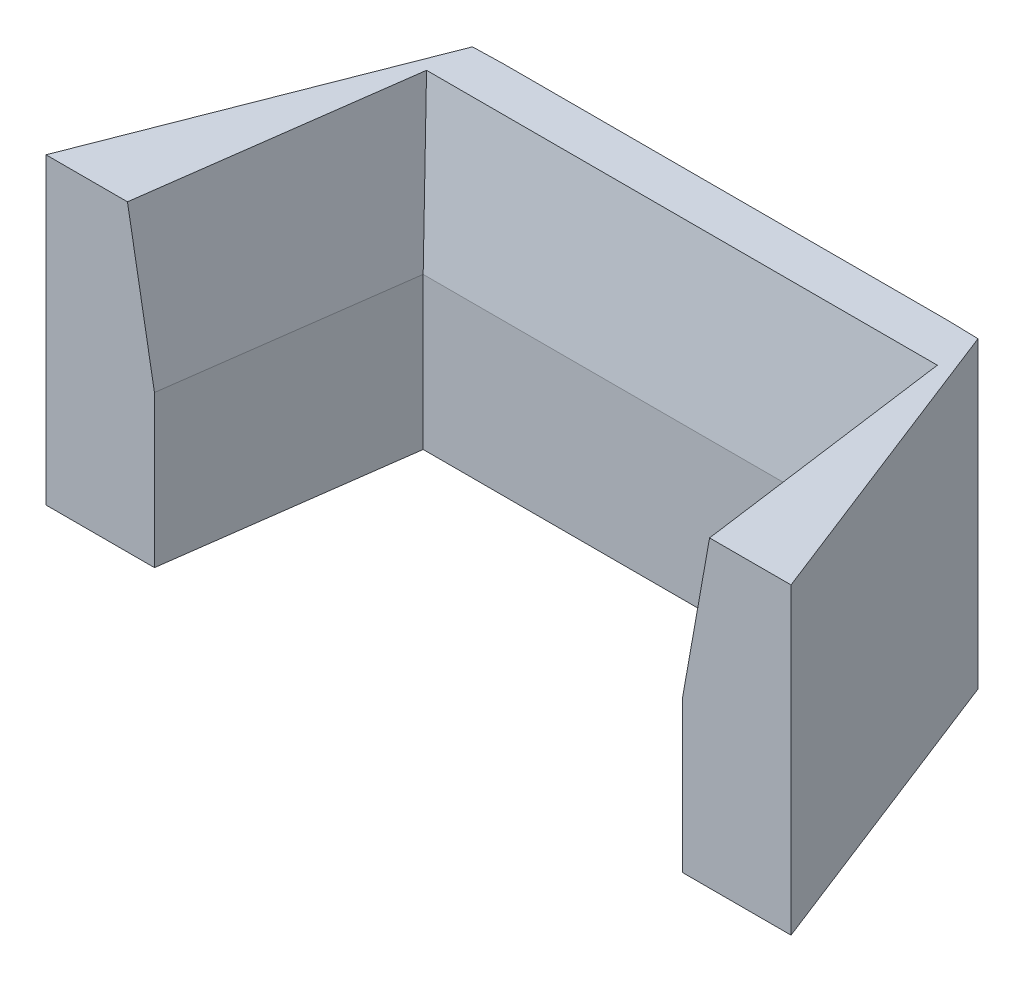
ISO-10303-21;
HEADER;
FILE_DESCRIPTION(('STEP AP214'),'2;1');
FILE_NAME('part.step','',(''),(''),'','','');
FILE_SCHEMA(('AUTOMOTIVE_DESIGN { 1 0 10303 214 1 1 1 1 }'));
ENDSEC;
DATA;
#1=APPLICATION_CONTEXT('core data for automotive mechanical design processes');
#2=APPLICATION_PROTOCOL_DEFINITION('international standard','automotive_design',2000,#1);
#3=PRODUCT_CONTEXT('',#1,'mechanical');
#4=PRODUCT('Part','Part','',(#3));
#5=PRODUCT_RELATED_PRODUCT_CATEGORY('part','',(#4));
#6=PRODUCT_DEFINITION_FORMATION('','',#4);
#7=PRODUCT_DEFINITION_CONTEXT('part definition',#1,'design');
#8=PRODUCT_DEFINITION('design','',#6,#7);
#9=PRODUCT_DEFINITION_SHAPE('','',#8);
#10=(LENGTH_UNIT() NAMED_UNIT(*) SI_UNIT(.MILLI.,.METRE.));
#11=(NAMED_UNIT(*) PLANE_ANGLE_UNIT() SI_UNIT($,.RADIAN.));
#12=(NAMED_UNIT(*) SI_UNIT($,.STERADIAN.) SOLID_ANGLE_UNIT());
#13=UNCERTAINTY_MEASURE_WITH_UNIT(LENGTH_MEASURE(1.E-05),#10,'distance_accuracy_value','');
#14=(GEOMETRIC_REPRESENTATION_CONTEXT(3) GLOBAL_UNCERTAINTY_ASSIGNED_CONTEXT((#13)) GLOBAL_UNIT_ASSIGNED_CONTEXT((#10,
#11,#12)) REPRESENTATION_CONTEXT('',''));
#15=CARTESIAN_POINT('',(0.,0.,0.));
#16=DIRECTION('',(0.,0.,1.));
#17=DIRECTION('',(1.,0.,0.));
#18=AXIS2_PLACEMENT_3D('',#15,#16,#17);
#19=CARTESIAN_POINT('',(0.,0.,0.));
#20=DIRECTION('',(0.,1.,0.));
#21=DIRECTION('',(0.,0.,1.));
#22=AXIS2_PLACEMENT_3D('',#19,#20,#21);
#23=PLANE('',#22);
#24=DIRECTION('',(0.363647232726733,0.,0.931536735792094));
#25=VECTOR('',#24,1.);
#26=CARTESIAN_POINT('',(56.9130403915651,0.,-22.2173413556893));
#27=LINE('',#26,#25);
#28=CARTESIAN_POINT('',(51.793050571942,0.,-35.3329604904692));
#29=VERTEX_POINT('',#28);
#30=CARTESIAN_POINT('',(63.6342337684254,0.,-5.));
#31=VERTEX_POINT('',#30);
#32=EDGE_CURVE('E219',#29,#31,#27,.T.);
#33=ORIENTED_EDGE('',*,*,#32,.T.);
#34=DIRECTION('',(-1.,0.,0.));
#35=VECTOR('',#34,1.);
#36=CARTESIAN_POINT('',(0.,0.,-5.));
#37=LINE('',#36,#35);
#38=CARTESIAN_POINT('',(52.9092805715327,0.,-5.));
#39=VERTEX_POINT('',#38);
#40=EDGE_CURVE('E247',#31,#39,#37,.T.);
#41=ORIENTED_EDGE('',*,*,#40,.T.);
#42=DIRECTION('',(-0.134140733099768,0.,-0.990962291776764));
#43=VECTOR('',#42,1.);
#44=CARTESIAN_POINT('',(52.6218869718127,0.,-7.12311513169284));
#45=LINE('',#44,#43);
#46=CARTESIAN_POINT('',(49.7405993732337,0.,-28.4085762737028));
#47=VERTEX_POINT('',#46);
#48=EDGE_CURVE('E216',#39,#47,#45,.T.);
#49=ORIENTED_EDGE('',*,*,#48,.T.);
#50=DIRECTION('',(1.,0.,0.));
#51=VECTOR('',#50,1.);
#52=CARTESIAN_POINT('',(0.,0.,-28.4085762737027));
#53=LINE('',#52,#51);
#54=CARTESIAN_POINT('',(3.84550177065023,0.,-28.4085762737027));
#55=VERTEX_POINT('',#54);
#56=EDGE_CURVE('E213',#55,#47,#53,.T.);
#57=ORIENTED_EDGE('',*,*,#56,.F.);
#58=DIRECTION('',(0.134140733099768,0.,-0.990962291776764));
#59=VECTOR('',#58,1.);
#60=CARTESIAN_POINT('',(0.,0.,0.));
#61=LINE('',#60,#59);
#62=CARTESIAN_POINT('',(0.676820572351203,0.,-5.));
#63=VERTEX_POINT('',#62);
#64=EDGE_CURVE('E195',#63,#55,#61,.T.);
#65=ORIENTED_EDGE('',*,*,#64,.F.);
#66=CARTESIAN_POINT('',(-10.0481326245415,0.,-5.));
#67=VERTEX_POINT('',#66);
#68=EDGE_CURVE('E244',#63,#67,#37,.T.);
#69=ORIENTED_EDGE('',*,*,#68,.T.);
#70=DIRECTION('',(-0.363647232726733,0.,0.931536735792094));
#71=VECTOR('',#70,1.);
#72=CARTESIAN_POINT('',(-10.4131282815623,0.,-4.06500907384906));
#73=LINE('',#72,#71);
#74=CARTESIAN_POINT('',(1.79305057194196,0.,-35.3329604904691));
#75=VERTEX_POINT('',#74);
#76=EDGE_CURVE('E200',#75,#67,#73,.T.);
#77=ORIENTED_EDGE('',*,*,#76,.F.);
#78=DIRECTION('',(-0.999682498681667,0.,0.0251972583742492));
#79=VECTOR('',#78,1.);
#80=CARTESIAN_POINT('',(-0.888872654082395,0.,-35.2653619153664));
#81=LINE('',#80,#79);
#82=CARTESIAN_POINT('',(4.79305057194196,0.,-35.4085762737027));
#83=VERTEX_POINT('',#82);
#84=EDGE_CURVE('E227',#83,#75,#81,.T.);
#85=ORIENTED_EDGE('',*,*,#84,.F.);
#86=DIRECTION('',(-1.,0.,0.));
#87=VECTOR('',#86,1.);
#88=CARTESIAN_POINT('',(0.,0.,-35.4085762737027));
#89=LINE('',#88,#87);
#90=CARTESIAN_POINT('',(48.793050571942,0.,-35.4085762737027));
#91=VERTEX_POINT('',#90);
#92=EDGE_CURVE('E225',#91,#83,#89,.T.);
#93=ORIENTED_EDGE('',*,*,#92,.F.);
#94=DIRECTION('',(0.999682498681667,0.,0.0251972583742492));
#95=VECTOR('',#94,1.);
#96=CARTESIAN_POINT('',(0.922894567738637,0.,-36.6151560536271));
#97=LINE('',#96,#95);
#98=EDGE_CURVE('E222',#91,#29,#97,.T.);
#99=ORIENTED_EDGE('',*,*,#98,.T.);
#100=EDGE_LOOP('',(#33,#41,#49,#57,#65,#69,#77,#85,#93,#99));
#101=FACE_BOUND('',#100,.T.);
#102=DIRECTION('',(0.,0.,-1.));
#103=VECTOR('',#102,1.);
#104=CARTESIAN_POINT('',(16.793050571942,0.,-31.4085762737027));
#105=LINE('',#104,#103);
#106=CARTESIAN_POINT('',(16.793050571942,0.,-31.4085762737027));
#107=VERTEX_POINT('',#106);
#108=CARTESIAN_POINT('',(16.793050571942,0.,-33.4085762737027));
#109=VERTEX_POINT('',#108);
#110=EDGE_CURVE('E176',#107,#109,#105,.T.);
#111=ORIENTED_EDGE('',*,*,#110,.F.);
#112=DIRECTION('',(-1.,0.,0.));
#113=VECTOR('',#112,1.);
#114=CARTESIAN_POINT('',(16.793050571942,0.,-31.4085762737027));
#115=LINE('',#114,#113);
#116=CARTESIAN_POINT('',(36.793050571942,0.,-31.4085762737027));
#117=VERTEX_POINT('',#116);
#118=EDGE_CURVE('E173',#117,#107,#115,.T.);
#119=ORIENTED_EDGE('',*,*,#118,.F.);
#120=DIRECTION('',(0.,0.,1.));
#121=VECTOR('',#120,1.);
#122=CARTESIAN_POINT('',(36.793050571942,0.,-31.4085762737027));
#123=LINE('',#122,#121);
#124=CARTESIAN_POINT('',(36.793050571942,0.,-33.4085762737027));
#125=VERTEX_POINT('',#124);
#126=EDGE_CURVE('E271',#125,#117,#123,.T.);
#127=ORIENTED_EDGE('',*,*,#126,.F.);
#128=DIRECTION('',(1.,0.,0.));
#129=VECTOR('',#128,1.);
#130=CARTESIAN_POINT('',(16.793050571942,0.,-33.4085762737027));
#131=LINE('',#130,#129);
#132=EDGE_CURVE('E269',#109,#125,#131,.T.);
#133=ORIENTED_EDGE('',*,*,#132,.F.);
#134=EDGE_LOOP('',(#111,#119,#127,#133));
#135=FACE_BOUND('',#134,.T.);
#136=ADVANCED_FACE('F37',(#101,#135),#23,.F.);
#137=CARTESIAN_POINT('',(0.,30.,0.));
#138=DIRECTION('',(-0.990962291776764,0.,-0.134140733099768));
#139=DIRECTION('',(-0.134140733099768,0.,0.990962291776764));
#140=AXIS2_PLACEMENT_3D('',#137,#138,#139);
#141=PLANE('',#140);
#142=DIRECTION('',(0.,-1.,0.));
#143=VECTOR('',#142,1.);
#144=CARTESIAN_POINT('',(3.84550177065023,30.,-28.4085762737027));
#145=LINE('',#144,#143);
#146=CARTESIAN_POINT('',(3.84550177065023,14.9999999999997,-28.4085762737027));
#147=VERTEX_POINT('',#146);
#148=EDGE_CURVE('E242',#147,#55,#145,.T.);
#149=ORIENTED_EDGE('',*,*,#148,.F.);
#150=DIRECTION('',(-0.134140733099768,0.,0.990962291776764));
#151=VECTOR('',#150,1.);
#152=CARTESIAN_POINT('',(0.676820572351233,14.9999999999997,-5.));
#153=LINE('',#152,#151);
#154=CARTESIAN_POINT('',(0.676820572351233,14.9999999999997,-5.));
#155=VERTEX_POINT('',#154);
#156=EDGE_CURVE('E47',#147,#155,#153,.T.);
#157=ORIENTED_EDGE('',*,*,#156,.T.);
#158=DIRECTION('',(0.,-1.,0.));
#159=VECTOR('',#158,1.);
#160=CARTESIAN_POINT('',(0.676820572351233,30.,-5.));
#161=LINE('',#160,#159);
#162=EDGE_CURVE('E193',#155,#63,#161,.T.);
#163=ORIENTED_EDGE('',*,*,#162,.T.);
#164=ORIENTED_EDGE('',*,*,#64,.T.);
#165=EDGE_LOOP('',(#149,#157,#163,#164));
#166=FACE_BOUND('',#165,.T.);
#167=ADVANCED_FACE('F289',(#166),#141,.F.);
#168=CARTESIAN_POINT('',(0.,30.,-28.4085762737027));
#169=DIRECTION('',(0.,0.,-1.));
#170=DIRECTION('',(-1.,0.,0.));
#171=AXIS2_PLACEMENT_3D('',#168,#169,#170);
#172=PLANE('',#171);
#173=DIRECTION('',(0.,-1.,0.));
#174=VECTOR('',#173,1.);
#175=CARTESIAN_POINT('',(49.7405993732337,30.,-28.4085762737028));
#176=LINE('',#175,#174);
#177=CARTESIAN_POINT('',(49.7405993732337,14.9999999999997,-28.4085762737028));
#178=VERTEX_POINT('',#177);
#179=EDGE_CURVE('E240',#178,#47,#176,.T.);
#180=ORIENTED_EDGE('',*,*,#179,.F.);
#181=DIRECTION('',(-1.,0.,0.));
#182=VECTOR('',#181,1.);
#183=CARTESIAN_POINT('',(3.84550177065023,14.9999999999997,-28.4085762737027));
#184=LINE('',#183,#182);
#185=EDGE_CURVE('E62',#178,#147,#184,.T.);
#186=ORIENTED_EDGE('',*,*,#185,.T.);
#187=ORIENTED_EDGE('',*,*,#148,.T.);
#188=ORIENTED_EDGE('',*,*,#56,.T.);
#189=EDGE_LOOP('',(#180,#186,#187,#188));
#190=FACE_BOUND('',#189,.T.);
#191=ADVANCED_FACE('F296',(#190),#172,.F.);
#192=CARTESIAN_POINT('',(52.6218869718127,30.,-7.12311513169284));
#193=DIRECTION('',(-0.990962291776764,0.,0.134140733099768));
#194=DIRECTION('',(0.134140733099768,0.,0.990962291776764));
#195=AXIS2_PLACEMENT_3D('',#192,#193,#194);
#196=PLANE('',#195);
#197=DIRECTION('',(0.,-1.,0.));
#198=VECTOR('',#197,1.);
#199=CARTESIAN_POINT('',(52.9092805715327,30.,-5.));
#200=LINE('',#199,#198);
#201=CARTESIAN_POINT('',(52.9092805715327,14.9999999999997,-5.));
#202=VERTEX_POINT('',#201);
#203=EDGE_CURVE('E191',#202,#39,#200,.T.);
#204=ORIENTED_EDGE('',*,*,#203,.F.);
#205=DIRECTION('',(-0.134140733099768,0.,-0.990962291776764));
#206=VECTOR('',#205,1.);
#207=CARTESIAN_POINT('',(52.6218869718127,14.9999999999997,-7.12311513169284));
#208=LINE('',#207,#206);
#209=EDGE_CURVE('E248',#202,#178,#208,.T.);
#210=ORIENTED_EDGE('',*,*,#209,.T.);
#211=ORIENTED_EDGE('',*,*,#179,.T.);
#212=ORIENTED_EDGE('',*,*,#48,.F.);
#213=EDGE_LOOP('',(#204,#210,#211,#212));
#214=FACE_BOUND('',#213,.T.);
#215=ADVANCED_FACE('F321',(#214),#196,.T.);
#216=CARTESIAN_POINT('',(56.9130403915651,30.,-22.2173413556893));
#217=DIRECTION('',(0.931536735792094,0.,-0.363647232726733));
#218=DIRECTION('',(-0.363647232726733,0.,-0.931536735792094));
#219=AXIS2_PLACEMENT_3D('',#216,#217,#218);
#220=PLANE('',#219);
#221=DIRECTION('',(0.,1.,0.));
#222=VECTOR('',#221,1.);
#223=CARTESIAN_POINT('',(63.6342337684255,30.,-5.));
#224=LINE('',#223,#222);
#225=CARTESIAN_POINT('',(63.6342337684254,30.,-5.));
#226=VERTEX_POINT('',#225);
#227=EDGE_CURVE('E188',#31,#226,#224,.T.);
#228=ORIENTED_EDGE('',*,*,#227,.F.);
#229=ORIENTED_EDGE('',*,*,#32,.F.);
#230=DIRECTION('',(0.,-1.,0.));
#231=VECTOR('',#230,1.);
#232=CARTESIAN_POINT('',(51.793050571942,30.,-35.3329604904692));
#233=LINE('',#232,#231);
#234=CARTESIAN_POINT('',(51.793050571942,30.,-35.3329604904692));
#235=VERTEX_POINT('',#234);
#236=EDGE_CURVE('E238',#235,#29,#233,.T.);
#237=ORIENTED_EDGE('',*,*,#236,.F.);
#238=DIRECTION('',(0.363647232726733,0.,0.931536735792094));
#239=VECTOR('',#238,1.);
#240=CARTESIAN_POINT('',(56.9130403915651,30.,-22.2173413556893));
#241=LINE('',#240,#239);
#242=EDGE_CURVE('E196',#235,#226,#241,.T.);
#243=ORIENTED_EDGE('',*,*,#242,.T.);
#244=EDGE_LOOP('',(#228,#229,#237,#243));
#245=FACE_BOUND('',#244,.T.);
#246=ADVANCED_FACE('F317',(#245),#220,.T.);
#247=CARTESIAN_POINT('',(0.922894567738637,30.,-36.6151560536271));
#248=DIRECTION('',(0.0251972583742492,0.,-0.999682498681667));
#249=DIRECTION('',(-0.999682498681667,0.,-0.0251972583742492));
#250=AXIS2_PLACEMENT_3D('',#247,#248,#249);
#251=PLANE('',#250);
#252=ORIENTED_EDGE('',*,*,#98,.F.);
#253=DIRECTION('',(0.,-1.,0.));
#254=VECTOR('',#253,1.);
#255=CARTESIAN_POINT('',(48.793050571942,30.,-35.4085762737027));
#256=LINE('',#255,#254);
#257=CARTESIAN_POINT('',(48.793050571942,30.,-35.4085762737027));
#258=VERTEX_POINT('',#257);
#259=EDGE_CURVE('E236',#258,#91,#256,.T.);
#260=ORIENTED_EDGE('',*,*,#259,.F.);
#261=DIRECTION('',(0.999682498681667,0.,0.0251972583742492));
#262=VECTOR('',#261,1.);
#263=CARTESIAN_POINT('',(0.922894567738637,30.,-36.6151560536271));
#264=LINE('',#263,#262);
#265=EDGE_CURVE('E199',#258,#235,#264,.T.);
#266=ORIENTED_EDGE('',*,*,#265,.T.);
#267=ORIENTED_EDGE('',*,*,#236,.T.);
#268=EDGE_LOOP('',(#252,#260,#266,#267));
#269=FACE_BOUND('',#268,.T.);
#270=ADVANCED_FACE('F313',(#269),#251,.T.);
#271=CARTESIAN_POINT('',(0.,30.,-35.4085762737027));
#272=DIRECTION('',(0.,0.,1.));
#273=DIRECTION('',(1.,0.,0.));
#274=AXIS2_PLACEMENT_3D('',#271,#272,#273);
#275=PLANE('',#274);
#276=ORIENTED_EDGE('',*,*,#92,.T.);
#277=DIRECTION('',(0.,-1.,0.));
#278=VECTOR('',#277,1.);
#279=CARTESIAN_POINT('',(4.79305057194196,30.,-35.4085762737027));
#280=LINE('',#279,#278);
#281=CARTESIAN_POINT('',(4.79305057194196,30.,-35.4085762737027));
#282=VERTEX_POINT('',#281);
#283=EDGE_CURVE('E233',#282,#83,#280,.T.);
#284=ORIENTED_EDGE('',*,*,#283,.F.);
#285=DIRECTION('',(-1.,0.,0.));
#286=VECTOR('',#285,1.);
#287=CARTESIAN_POINT('',(0.,30.,-35.4085762737027));
#288=LINE('',#287,#286);
#289=EDGE_CURVE('E203',#258,#282,#288,.T.);
#290=ORIENTED_EDGE('',*,*,#289,.F.);
#291=ORIENTED_EDGE('',*,*,#259,.T.);
#292=EDGE_LOOP('',(#276,#284,#290,#291));
#293=FACE_BOUND('',#292,.T.);
#294=ADVANCED_FACE('F309',(#293),#275,.F.);
#295=CARTESIAN_POINT('',(-0.888872654082395,30.,-35.2653619153664));
#296=DIRECTION('',(0.0251972583742492,0.,0.999682498681667));
#297=DIRECTION('',(0.999682498681667,0.,-0.0251972583742492));
#298=AXIS2_PLACEMENT_3D('',#295,#296,#297);
#299=PLANE('',#298);
#300=ORIENTED_EDGE('',*,*,#84,.T.);
#301=DIRECTION('',(0.,-1.,0.));
#302=VECTOR('',#301,1.);
#303=CARTESIAN_POINT('',(1.79305057194196,30.,-35.3329604904691));
#304=LINE('',#303,#302);
#305=CARTESIAN_POINT('',(1.79305057194196,30.,-35.3329604904691));
#306=VERTEX_POINT('',#305);
#307=EDGE_CURVE('E210',#306,#75,#304,.T.);
#308=ORIENTED_EDGE('',*,*,#307,.F.);
#309=DIRECTION('',(-0.999682498681667,0.,0.0251972583742492));
#310=VECTOR('',#309,1.);
#311=CARTESIAN_POINT('',(-0.888872654082395,30.,-35.2653619153664));
#312=LINE('',#311,#310);
#313=EDGE_CURVE('E205',#282,#306,#312,.T.);
#314=ORIENTED_EDGE('',*,*,#313,.F.);
#315=ORIENTED_EDGE('',*,*,#283,.T.);
#316=EDGE_LOOP('',(#300,#308,#314,#315));
#317=FACE_BOUND('',#316,.T.);
#318=ADVANCED_FACE('F305',(#317),#299,.F.);
#319=CARTESIAN_POINT('',(-10.4131282815623,30.,-4.06500907384906));
#320=DIRECTION('',(0.931536735792094,0.,0.363647232726733));
#321=DIRECTION('',(0.363647232726733,0.,-0.931536735792094));
#322=AXIS2_PLACEMENT_3D('',#319,#320,#321);
#323=PLANE('',#322);
#324=ORIENTED_EDGE('',*,*,#76,.T.);
#325=DIRECTION('',(0.,1.,0.));
#326=VECTOR('',#325,1.);
#327=CARTESIAN_POINT('',(-10.0481326245415,30.,-5.));
#328=LINE('',#327,#326);
#329=CARTESIAN_POINT('',(-10.0481326245416,30.,-5.));
#330=VERTEX_POINT('',#329);
#331=EDGE_CURVE('E185',#67,#330,#328,.T.);
#332=ORIENTED_EDGE('',*,*,#331,.T.);
#333=DIRECTION('',(-0.363647232726733,0.,0.931536735792094));
#334=VECTOR('',#333,1.);
#335=CARTESIAN_POINT('',(-10.4131282815623,30.,-4.06500907384906));
#336=LINE('',#335,#334);
#337=EDGE_CURVE('E207',#306,#330,#336,.T.);
#338=ORIENTED_EDGE('',*,*,#337,.F.);
#339=ORIENTED_EDGE('',*,*,#307,.T.);
#340=EDGE_LOOP('',(#324,#332,#338,#339));
#341=FACE_BOUND('',#340,.T.);
#342=ADVANCED_FACE('F302',(#341),#323,.F.);
#343=CARTESIAN_POINT('',(0.,30.,0.));
#344=DIRECTION('',(0.,1.,0.));
#345=DIRECTION('',(0.,0.,1.));
#346=AXIS2_PLACEMENT_3D('',#343,#344,#345);
#347=PLANE('',#346);
#348=DIRECTION('',(1.,0.,0.));
#349=VECTOR('',#348,1.);
#350=CARTESIAN_POINT('',(49.7405993732337,30.,-31.0534809843297));
#351=LINE('',#350,#349);
#352=CARTESIAN_POINT('',(1.53450036043679,30.,-31.0534809843297));
#353=VERTEX_POINT('',#352);
#354=CARTESIAN_POINT('',(52.0516007834471,30.,-31.0534809843297));
#355=VERTEX_POINT('',#354);
#356=EDGE_CURVE('E253',#353,#355,#351,.T.);
#357=ORIENTED_EDGE('',*,*,#356,.T.);
#358=DIRECTION('',(0.134140733099768,0.,0.990962291776764));
#359=VECTOR('',#358,1.);
#360=CARTESIAN_POINT('',(55.2428878053868,30.,-7.47790458855537));
#361=LINE('',#360,#359);
#362=CARTESIAN_POINT('',(55.5783071657583,30.,-5.));
#363=VERTEX_POINT('',#362);
#364=EDGE_CURVE('E255',#355,#363,#361,.T.);
#365=ORIENTED_EDGE('',*,*,#364,.T.);
#366=DIRECTION('',(1.,0.,0.));
#367=VECTOR('',#366,1.);
#368=CARTESIAN_POINT('',(-90.,30.,-5.));
#369=LINE('',#368,#367);
#370=EDGE_CURVE('E177',#363,#226,#369,.T.);
#371=ORIENTED_EDGE('',*,*,#370,.T.);
#372=ORIENTED_EDGE('',*,*,#242,.F.);
#373=ORIENTED_EDGE('',*,*,#265,.F.);
#374=ORIENTED_EDGE('',*,*,#289,.T.);
#375=ORIENTED_EDGE('',*,*,#313,.T.);
#376=ORIENTED_EDGE('',*,*,#337,.T.);
#377=CARTESIAN_POINT('',(-1.99220602187444,30.,-5.));
#378=VERTEX_POINT('',#377);
#379=EDGE_CURVE('E179',#330,#378,#369,.T.);
#380=ORIENTED_EDGE('',*,*,#379,.T.);
#381=DIRECTION('',(0.134140733099768,0.,-0.990962291776764));
#382=VECTOR('',#381,1.);
#383=CARTESIAN_POINT('',(1.22450093707616,30.,-28.7633657305653));
#384=LINE('',#383,#382);
#385=EDGE_CURVE('E251',#378,#353,#384,.T.);
#386=ORIENTED_EDGE('',*,*,#385,.T.);
#387=EDGE_LOOP('',(#357,#365,#371,#372,#373,#374,#375,#376,#380,#386));
#388=FACE_BOUND('',#387,.T.);
#389=ADVANCED_FACE('F300',(#388),#347,.T.);
#390=CARTESIAN_POINT('',(-90.,0.,-5.));
#391=DIRECTION('',(0.,0.,-1.));
#392=DIRECTION('',(-1.,0.,0.));
#393=AXIS2_PLACEMENT_3D('',#390,#391,#392);
#394=PLANE('',#393);
#395=ORIENTED_EDGE('',*,*,#162,.F.);
#396=DIRECTION('',(-0.175183482743592,0.984535802992367,0.));
#397=VECTOR('',#396,1.);
#398=CARTESIAN_POINT('',(-2.01150326470069,30.1084510146959,-5.));
#399=LINE('',#398,#397);
#400=EDGE_CURVE('E11',#155,#378,#399,.T.);
#401=ORIENTED_EDGE('',*,*,#400,.T.);
#402=ORIENTED_EDGE('',*,*,#379,.F.);
#403=ORIENTED_EDGE('',*,*,#331,.F.);
#404=ORIENTED_EDGE('',*,*,#68,.F.);
#405=EDGE_LOOP('',(#395,#401,#402,#403,#404));
#406=FACE_BOUND('',#405,.T.);
#407=ADVANCED_FACE('F350',(#406),#394,.F.);
#408=ORIENTED_EDGE('',*,*,#370,.F.);
#409=DIRECTION('',(0.175183482743592,0.984535802992367,0.));
#410=VECTOR('',#409,1.);
#411=CARTESIAN_POINT('',(52.9004606767477,14.9504319582048,-5.));
#412=LINE('',#411,#410);
#413=EDGE_CURVE('E257',#363,#202,#412,.F.);
#414=ORIENTED_EDGE('',*,*,#413,.T.);
#415=ORIENTED_EDGE('',*,*,#203,.T.);
#416=ORIENTED_EDGE('',*,*,#40,.F.);
#417=ORIENTED_EDGE('',*,*,#227,.T.);
#418=EDGE_LOOP('',(#408,#414,#415,#416,#417));
#419=FACE_BOUND('',#418,.T.);
#420=ADVANCED_FACE('F367',(#419),#394,.F.);
#421=CARTESIAN_POINT('',(16.793050571942,-3.,-31.4085762737027));
#422=DIRECTION('',(1.,0.,0.));
#423=DIRECTION('',(0.,0.,-1.));
#424=AXIS2_PLACEMENT_3D('',#421,#422,#423);
#425=PLANE('',#424);
#426=ORIENTED_EDGE('',*,*,#110,.T.);
#427=DIRECTION('',(0.,1.,0.));
#428=VECTOR('',#427,1.);
#429=CARTESIAN_POINT('',(16.793050571942,-3.,-33.4085762737027));
#430=LINE('',#429,#428);
#431=CARTESIAN_POINT('',(16.793050571942,-3.,-33.4085762737027));
#432=VERTEX_POINT('',#431);
#433=EDGE_CURVE('E157',#432,#109,#430,.T.);
#434=ORIENTED_EDGE('',*,*,#433,.F.);
#435=DIRECTION('',(0.,0.,-1.));
#436=VECTOR('',#435,1.);
#437=CARTESIAN_POINT('',(16.793050571942,-3.,-31.4085762737027));
#438=LINE('',#437,#436);
#439=CARTESIAN_POINT('',(16.793050571942,-3.,-31.4085762737027));
#440=VERTEX_POINT('',#439);
#441=EDGE_CURVE('E164',#440,#432,#438,.T.);
#442=ORIENTED_EDGE('',*,*,#441,.F.);
#443=DIRECTION('',(0.,1.,0.));
#444=VECTOR('',#443,1.);
#445=CARTESIAN_POINT('',(16.793050571942,-3.,-31.4085762737027));
#446=LINE('',#445,#444);
#447=EDGE_CURVE('E280',#440,#107,#446,.T.);
#448=ORIENTED_EDGE('',*,*,#447,.T.);
#449=EDGE_LOOP('',(#426,#434,#442,#448));
#450=FACE_BOUND('',#449,.T.);
#451=ADVANCED_FACE('F175',(#450),#425,.F.);
#452=CARTESIAN_POINT('',(16.793050571942,-3.,-33.4085762737027));
#453=DIRECTION('',(0.,0.,1.));
#454=DIRECTION('',(1.,0.,0.));
#455=AXIS2_PLACEMENT_3D('',#452,#453,#454);
#456=PLANE('',#455);
#457=ORIENTED_EDGE('',*,*,#132,.T.);
#458=DIRECTION('',(0.,1.,0.));
#459=VECTOR('',#458,1.);
#460=CARTESIAN_POINT('',(36.793050571942,-3.,-33.4085762737027));
#461=LINE('',#460,#459);
#462=CARTESIAN_POINT('',(36.793050571942,-3.,-33.4085762737027));
#463=VERTEX_POINT('',#462);
#464=EDGE_CURVE('E160',#463,#125,#461,.T.);
#465=ORIENTED_EDGE('',*,*,#464,.F.);
#466=DIRECTION('',(1.,0.,0.));
#467=VECTOR('',#466,1.);
#468=CARTESIAN_POINT('',(16.793050571942,-3.,-33.4085762737027));
#469=LINE('',#468,#467);
#470=EDGE_CURVE('E152',#432,#463,#469,.T.);
#471=ORIENTED_EDGE('',*,*,#470,.F.);
#472=ORIENTED_EDGE('',*,*,#433,.T.);
#473=EDGE_LOOP('',(#457,#465,#471,#472));
#474=FACE_BOUND('',#473,.T.);
#475=ADVANCED_FACE('F155',(#474),#456,.F.);
#476=CARTESIAN_POINT('',(36.793050571942,-3.,-31.4085762737027));
#477=DIRECTION('',(-1.,0.,0.));
#478=DIRECTION('',(0.,0.,1.));
#479=AXIS2_PLACEMENT_3D('',#476,#477,#478);
#480=PLANE('',#479);
#481=ORIENTED_EDGE('',*,*,#126,.T.);
#482=DIRECTION('',(0.,1.,0.));
#483=VECTOR('',#482,1.);
#484=CARTESIAN_POINT('',(36.793050571942,-3.,-31.4085762737027));
#485=LINE('',#484,#483);
#486=CARTESIAN_POINT('',(36.793050571942,-3.,-31.4085762737027));
#487=VERTEX_POINT('',#486);
#488=EDGE_CURVE('E181',#487,#117,#485,.T.);
#489=ORIENTED_EDGE('',*,*,#488,.F.);
#490=DIRECTION('',(0.,0.,1.));
#491=VECTOR('',#490,1.);
#492=CARTESIAN_POINT('',(36.793050571942,-3.,-31.4085762737027));
#493=LINE('',#492,#491);
#494=EDGE_CURVE('E163',#463,#487,#493,.T.);
#495=ORIENTED_EDGE('',*,*,#494,.F.);
#496=ORIENTED_EDGE('',*,*,#464,.T.);
#497=EDGE_LOOP('',(#481,#489,#495,#496));
#498=FACE_BOUND('',#497,.T.);
#499=ADVANCED_FACE('F286',(#498),#480,.F.);
#500=CARTESIAN_POINT('',(16.793050571942,-3.,-31.4085762737027));
#501=DIRECTION('',(0.,0.,-1.));
#502=DIRECTION('',(-1.,0.,0.));
#503=AXIS2_PLACEMENT_3D('',#500,#501,#502);
#504=PLANE('',#503);
#505=ORIENTED_EDGE('',*,*,#118,.T.);
#506=ORIENTED_EDGE('',*,*,#447,.F.);
#507=DIRECTION('',(-1.,0.,0.));
#508=VECTOR('',#507,1.);
#509=CARTESIAN_POINT('',(16.793050571942,-3.,-31.4085762737027));
#510=LINE('',#509,#508);
#511=EDGE_CURVE('E169',#487,#440,#510,.T.);
#512=ORIENTED_EDGE('',*,*,#511,.F.);
#513=ORIENTED_EDGE('',*,*,#488,.T.);
#514=EDGE_LOOP('',(#505,#506,#512,#513));
#515=FACE_BOUND('',#514,.T.);
#516=ADVANCED_FACE('F284',(#515),#504,.F.);
#517=CARTESIAN_POINT('',(0.,-3.,0.));
#518=DIRECTION('',(0.,-1.,0.));
#519=DIRECTION('',(0.,0.,-1.));
#520=AXIS2_PLACEMENT_3D('',#517,#518,#519);
#521=PLANE('',#520);
#522=ORIENTED_EDGE('',*,*,#441,.T.);
#523=ORIENTED_EDGE('',*,*,#470,.T.);
#524=ORIENTED_EDGE('',*,*,#494,.T.);
#525=ORIENTED_EDGE('',*,*,#511,.T.);
#526=EDGE_LOOP('',(#522,#523,#524,#525));
#527=FACE_BOUND('',#526,.T.);
#528=ADVANCED_FACE('F167',(#527),#521,.T.);
#529=CARTESIAN_POINT('',(-2.62100083357407,30.,-0.354789456862532));
#530=DIRECTION('',(0.975907347884504,0.173648177666927,0.132102833951393));
#531=DIRECTION('',(-0.134140733099768,0.,0.990962291776764));
#532=AXIS2_PLACEMENT_3D('',#529,#530,#531);
#533=PLANE('',#532);
#534=ORIENTED_EDGE('',*,*,#400,.F.);
#535=ORIENTED_EDGE('',*,*,#156,.F.);
#536=DIRECTION('',(-0.15000929633884,0.973664245784614,-0.171683276682982));
#537=VECTOR('',#536,1.);
#538=CARTESIAN_POINT('',(1.49996982262376,30.2241271099647,-31.0930006409247));
#539=LINE('',#538,#537);
#540=EDGE_CURVE('E42',#353,#147,#539,.F.);
#541=ORIENTED_EDGE('',*,*,#540,.F.);
#542=ORIENTED_EDGE('',*,*,#385,.F.);
#543=EDGE_LOOP('',(#534,#535,#541,#542));
#544=FACE_BOUND('',#543,.T.);
#545=ADVANCED_FACE('F40',(#544),#533,.T.);
#546=CARTESIAN_POINT('',(0.,30.,-31.0534809843297));
#547=DIRECTION('',(0.,0.173648177666927,0.984807753012208));
#548=DIRECTION('',(-1.,0.,0.));
#549=AXIS2_PLACEMENT_3D('',#546,#547,#548);
#550=PLANE('',#549);
#551=ORIENTED_EDGE('',*,*,#540,.T.);
#552=ORIENTED_EDGE('',*,*,#185,.F.);
#553=DIRECTION('',(-0.15000929633884,-0.973664245784614,0.171683276682983));
#554=VECTOR('',#553,1.);
#555=CARTESIAN_POINT('',(49.2572487507456,11.8627196395124,-27.8553891001021));
#556=LINE('',#555,#554);
#557=EDGE_CURVE('E260',#355,#178,#556,.T.);
#558=ORIENTED_EDGE('',*,*,#557,.F.);
#559=ORIENTED_EDGE('',*,*,#356,.F.);
#560=EDGE_LOOP('',(#551,#552,#558,#559));
#561=FACE_BOUND('',#560,.T.);
#562=ADVANCED_FACE('F334',(#561),#550,.T.);
#563=CARTESIAN_POINT('',(52.6218869718127,14.9999999999997,-7.12311513169284));
#564=DIRECTION('',(0.975907347884504,-0.173648177666927,-0.132102833951393));
#565=DIRECTION('',(-0.134140733099768,0.,-0.990962291776764));
#566=AXIS2_PLACEMENT_3D('',#563,#564,#565);
#567=PLANE('',#566);
#568=ORIENTED_EDGE('',*,*,#413,.F.);
#569=ORIENTED_EDGE('',*,*,#364,.F.);
#570=ORIENTED_EDGE('',*,*,#557,.T.);
#571=ORIENTED_EDGE('',*,*,#209,.F.);
#572=EDGE_LOOP('',(#568,#569,#570,#571));
#573=FACE_BOUND('',#572,.T.);
#574=ADVANCED_FACE('F329',(#573),#567,.F.);
#575=CLOSED_SHELL('',(#136,#167,#191,#215,#246,#270,#294,#318,#342,#389,#407,#420,#451,#475,
#499,#516,#528,#545,#562,#574));
#576=MANIFOLD_SOLID_BREP('B2',#575);
#577=ADVANCED_BREP_SHAPE_REPRESENTATION('',(#18,#576),#14);
#578=SHAPE_DEFINITION_REPRESENTATION(#9,#577);
ENDSEC;
END-ISO-10303-21;
